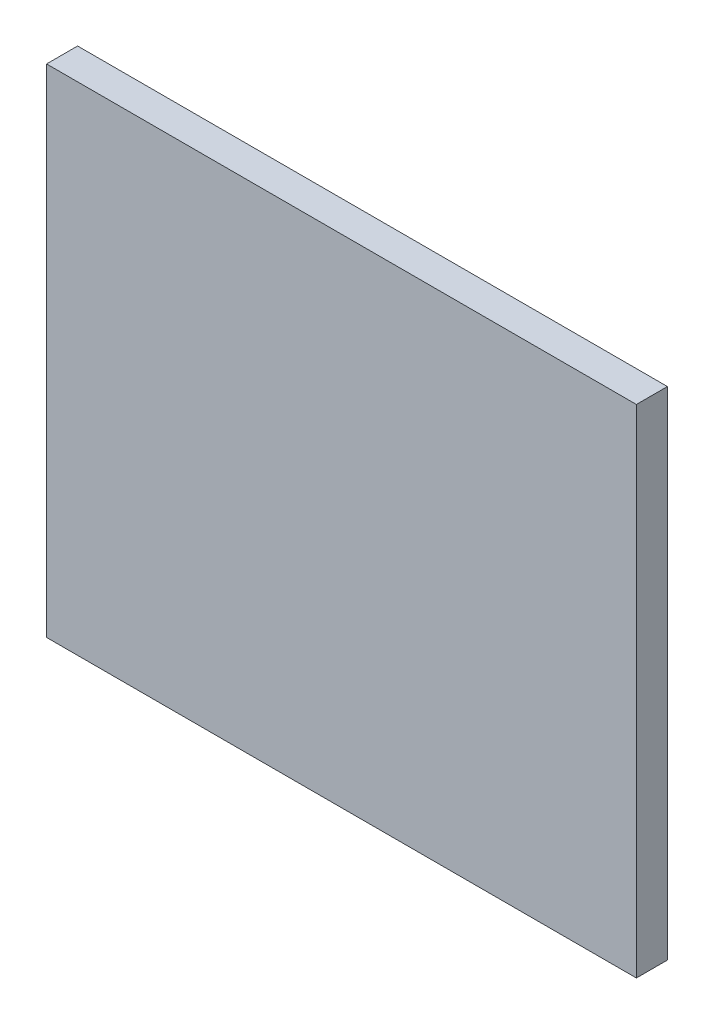
ISO-10303-21;
HEADER;
FILE_DESCRIPTION(('STEP AP214'),'2;1');
FILE_NAME('part.step','',(''),(''),'','','');
FILE_SCHEMA(('AUTOMOTIVE_DESIGN { 1 0 10303 214 1 1 1 1 }'));
ENDSEC;
DATA;
#1=APPLICATION_CONTEXT('core data for automotive mechanical design processes');
#2=APPLICATION_PROTOCOL_DEFINITION('international standard','automotive_design',2000,#1);
#3=PRODUCT_CONTEXT('',#1,'mechanical');
#4=PRODUCT('Part','Part','',(#3));
#5=PRODUCT_RELATED_PRODUCT_CATEGORY('part','',(#4));
#6=PRODUCT_DEFINITION_FORMATION('','',#4);
#7=PRODUCT_DEFINITION_CONTEXT('part definition',#1,'design');
#8=PRODUCT_DEFINITION('design','',#6,#7);
#9=PRODUCT_DEFINITION_SHAPE('','',#8);
#10=(LENGTH_UNIT() NAMED_UNIT(*) SI_UNIT(.MILLI.,.METRE.));
#11=(NAMED_UNIT(*) PLANE_ANGLE_UNIT() SI_UNIT($,.RADIAN.));
#12=(NAMED_UNIT(*) SI_UNIT($,.STERADIAN.) SOLID_ANGLE_UNIT());
#13=UNCERTAINTY_MEASURE_WITH_UNIT(LENGTH_MEASURE(1.E-05),#10,'distance_accuracy_value','');
#14=(GEOMETRIC_REPRESENTATION_CONTEXT(3) GLOBAL_UNCERTAINTY_ASSIGNED_CONTEXT((#13)) GLOBAL_UNIT_ASSIGNED_CONTEXT((#10,
#11,#12)) REPRESENTATION_CONTEXT('',''));
#15=CARTESIAN_POINT('',(0.,0.,0.));
#16=DIRECTION('',(0.,0.,1.));
#17=DIRECTION('',(1.,0.,0.));
#18=AXIS2_PLACEMENT_3D('',#15,#16,#17);
#19=CARTESIAN_POINT('',(0.,0.,0.55));
#20=DIRECTION('',(0.,0.,1.));
#21=DIRECTION('',(1.,0.,0.));
#22=AXIS2_PLACEMENT_3D('',#19,#20,#21);
#23=PLANE('',#22);
#24=DIRECTION('',(0.,1.,0.));
#25=VECTOR('',#24,1.);
#26=CARTESIAN_POINT('',(-0.475,0.4,0.55));
#27=LINE('',#26,#25);
#28=CARTESIAN_POINT('',(-0.475,-0.4,0.55));
#29=VERTEX_POINT('',#28);
#30=CARTESIAN_POINT('',(-0.475,0.4,0.55));
#31=VERTEX_POINT('',#30);
#32=EDGE_CURVE('E55',#29,#31,#27,.T.);
#33=ORIENTED_EDGE('',*,*,#32,.F.);
#34=DIRECTION('',(1.,0.,0.));
#35=VECTOR('',#34,1.);
#36=CARTESIAN_POINT('',(-0.775,-0.4,0.55));
#37=LINE('',#36,#35);
#38=CARTESIAN_POINT('',(0.475,-0.4,0.55));
#39=VERTEX_POINT('',#38);
#40=EDGE_CURVE('E20',#39,#29,#37,.F.);
#41=ORIENTED_EDGE('',*,*,#40,.F.);
#42=DIRECTION('',(0.,1.,0.));
#43=VECTOR('',#42,1.);
#44=CARTESIAN_POINT('',(0.475,0.4,0.55));
#45=LINE('',#44,#43);
#46=CARTESIAN_POINT('',(0.475,0.4,0.55));
#47=VERTEX_POINT('',#46);
#48=EDGE_CURVE('E81',#47,#39,#45,.F.);
#49=ORIENTED_EDGE('',*,*,#48,.F.);
#50=DIRECTION('',(1.,0.,0.));
#51=VECTOR('',#50,1.);
#52=CARTESIAN_POINT('',(0.775,0.4,0.55));
#53=LINE('',#52,#51);
#54=EDGE_CURVE('E68',#31,#47,#53,.T.);
#55=ORIENTED_EDGE('',*,*,#54,.F.);
#56=EDGE_LOOP('',(#33,#41,#49,#55));
#57=FACE_BOUND('',#56,.T.);
#58=ADVANCED_FACE('F17',(#57),#23,.T.);
#59=CARTESIAN_POINT('',(-0.775,-0.4,0.));
#60=DIRECTION('',(0.,-1.,0.));
#61=DIRECTION('',(0.,0.,-1.));
#62=AXIS2_PLACEMENT_3D('',#59,#60,#61);
#63=PLANE('',#62);
#64=ORIENTED_EDGE('',*,*,#40,.T.);
#65=DIRECTION('',(0.,0.,1.));
#66=VECTOR('',#65,1.);
#67=CARTESIAN_POINT('',(-0.475,-0.4,0.45));
#68=LINE('',#67,#66);
#69=CARTESIAN_POINT('',(-0.475,-0.4,0.5));
#70=VERTEX_POINT('',#69);
#71=EDGE_CURVE('E61',#70,#29,#68,.T.);
#72=ORIENTED_EDGE('',*,*,#71,.F.);
#73=DIRECTION('',(-1.,0.,0.));
#74=VECTOR('',#73,1.);
#75=CARTESIAN_POINT('',(-0.475,-0.4,0.5));
#76=LINE('',#75,#74);
#77=CARTESIAN_POINT('',(0.475,-0.4,0.5));
#78=VERTEX_POINT('',#77);
#79=EDGE_CURVE('E83',#78,#70,#76,.T.);
#80=ORIENTED_EDGE('',*,*,#79,.F.);
#81=DIRECTION('',(0.,0.,-1.));
#82=VECTOR('',#81,1.);
#83=CARTESIAN_POINT('',(0.475,-0.4,0.55));
#84=LINE('',#83,#82);
#85=EDGE_CURVE('E64',#39,#78,#84,.T.);
#86=ORIENTED_EDGE('',*,*,#85,.F.);
#87=EDGE_LOOP('',(#64,#72,#80,#86));
#88=FACE_BOUND('',#87,.T.);
#89=ADVANCED_FACE('F60',(#88),#63,.T.);
#90=CARTESIAN_POINT('',(-0.475,0.4,0.45));
#91=DIRECTION('',(-1.,0.,0.));
#92=DIRECTION('',(0.,0.,1.));
#93=AXIS2_PLACEMENT_3D('',#90,#91,#92);
#94=PLANE('',#93);
#95=DIRECTION('',(0.,0.,1.));
#96=VECTOR('',#95,1.);
#97=CARTESIAN_POINT('',(-0.475,0.4,0.));
#98=LINE('',#97,#96);
#99=CARTESIAN_POINT('',(-0.475,0.4,0.5));
#100=VERTEX_POINT('',#99);
#101=EDGE_CURVE('E70',#100,#31,#98,.T.);
#102=ORIENTED_EDGE('',*,*,#101,.F.);
#103=DIRECTION('',(0.,1.,0.));
#104=VECTOR('',#103,1.);
#105=CARTESIAN_POINT('',(-0.475,-0.4,0.5));
#106=LINE('',#105,#104);
#107=EDGE_CURVE('E74',#70,#100,#106,.T.);
#108=ORIENTED_EDGE('',*,*,#107,.F.);
#109=ORIENTED_EDGE('',*,*,#71,.T.);
#110=ORIENTED_EDGE('',*,*,#32,.T.);
#111=EDGE_LOOP('',(#102,#108,#109,#110));
#112=FACE_BOUND('',#111,.T.);
#113=ADVANCED_FACE('F72',(#112),#94,.T.);
#114=CARTESIAN_POINT('',(0.775,0.4,0.));
#115=DIRECTION('',(0.,1.,0.));
#116=DIRECTION('',(0.,0.,1.));
#117=AXIS2_PLACEMENT_3D('',#114,#115,#116);
#118=PLANE('',#117);
#119=ORIENTED_EDGE('',*,*,#54,.T.);
#120=DIRECTION('',(0.,0.,-1.));
#121=VECTOR('',#120,1.);
#122=CARTESIAN_POINT('',(0.475,0.4,0.55));
#123=LINE('',#122,#121);
#124=CARTESIAN_POINT('',(0.475,0.4,0.5));
#125=VERTEX_POINT('',#124);
#126=EDGE_CURVE('E35',#125,#47,#123,.F.);
#127=ORIENTED_EDGE('',*,*,#126,.F.);
#128=DIRECTION('',(-1.,0.,0.));
#129=VECTOR('',#128,1.);
#130=CARTESIAN_POINT('',(-0.475,0.4,0.5));
#131=LINE('',#130,#129);
#132=EDGE_CURVE('E26',#100,#125,#131,.F.);
#133=ORIENTED_EDGE('',*,*,#132,.F.);
#134=ORIENTED_EDGE('',*,*,#101,.T.);
#135=EDGE_LOOP('',(#119,#127,#133,#134));
#136=FACE_BOUND('',#135,.T.);
#137=ADVANCED_FACE('F89',(#136),#118,.T.);
#138=CARTESIAN_POINT('',(0.475,0.4,0.55));
#139=DIRECTION('',(1.,0.,0.));
#140=DIRECTION('',(0.,0.,-1.));
#141=AXIS2_PLACEMENT_3D('',#138,#139,#140);
#142=PLANE('',#141);
#143=ORIENTED_EDGE('',*,*,#126,.T.);
#144=ORIENTED_EDGE('',*,*,#48,.T.);
#145=ORIENTED_EDGE('',*,*,#85,.T.);
#146=DIRECTION('',(0.,1.,0.));
#147=VECTOR('',#146,1.);
#148=CARTESIAN_POINT('',(0.475,-0.4,0.5));
#149=LINE('',#148,#147);
#150=EDGE_CURVE('E11',#125,#78,#149,.F.);
#151=ORIENTED_EDGE('',*,*,#150,.F.);
#152=EDGE_LOOP('',(#143,#144,#145,#151));
#153=FACE_BOUND('',#152,.T.);
#154=ADVANCED_FACE('F91',(#153),#142,.T.);
#155=CARTESIAN_POINT('',(-0.475,-0.4,0.5));
#156=DIRECTION('',(0.,0.,-1.));
#157=DIRECTION('',(-1.,0.,0.));
#158=AXIS2_PLACEMENT_3D('',#155,#156,#157);
#159=PLANE('',#158);
#160=ORIENTED_EDGE('',*,*,#132,.T.);
#161=ORIENTED_EDGE('',*,*,#150,.T.);
#162=ORIENTED_EDGE('',*,*,#79,.T.);
#163=ORIENTED_EDGE('',*,*,#107,.T.);
#164=EDGE_LOOP('',(#160,#161,#162,#163));
#165=FACE_BOUND('',#164,.T.);
#166=ADVANCED_FACE('F88',(#165),#159,.T.);
#167=CLOSED_SHELL('',(#58,#89,#113,#137,#154,#166));
#168=MANIFOLD_SOLID_BREP('B1',#167);
#169=ADVANCED_BREP_SHAPE_REPRESENTATION('',(#18,#168),#14);
#170=SHAPE_DEFINITION_REPRESENTATION(#9,#169);
ENDSEC;
END-ISO-10303-21;
